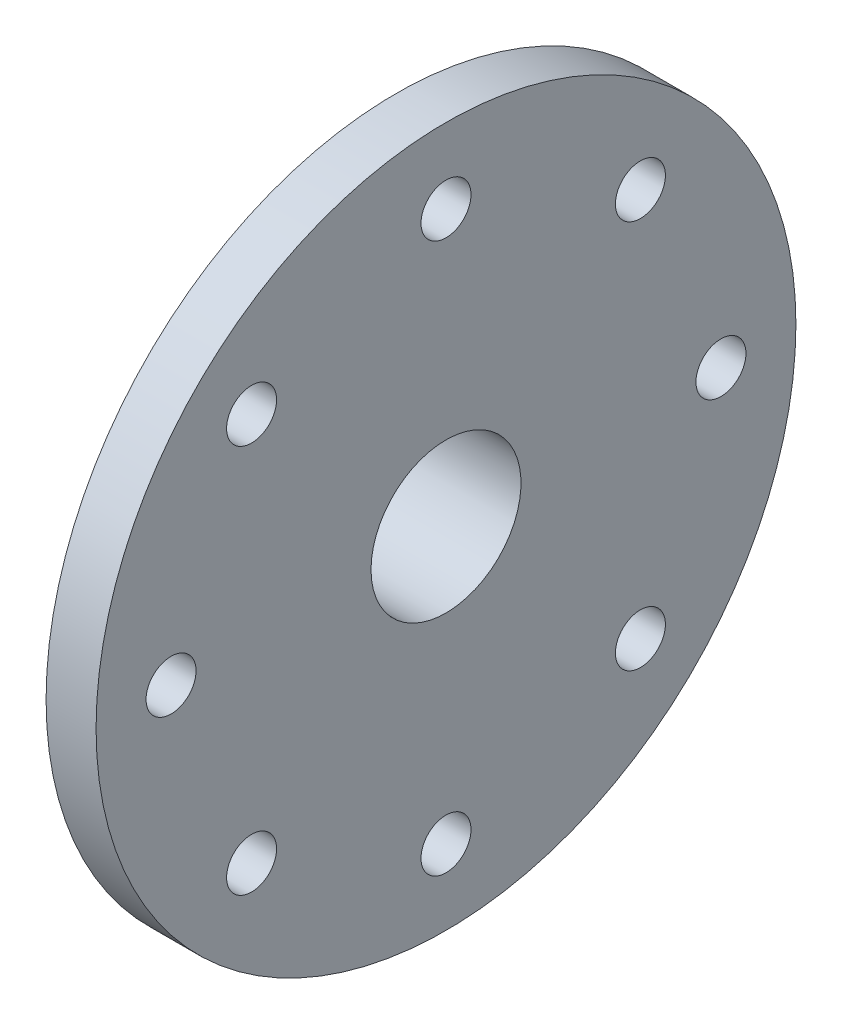
ISO-10303-21;
HEADER;
FILE_DESCRIPTION(('STEP AP214'),'2;1');
FILE_NAME('part.step','',(''),(''),'','','');
FILE_SCHEMA(('AUTOMOTIVE_DESIGN { 1 0 10303 214 1 1 1 1 }'));
ENDSEC;
DATA;
#1=APPLICATION_CONTEXT('core data for automotive mechanical design processes');
#2=APPLICATION_PROTOCOL_DEFINITION('international standard','automotive_design',2000,#1);
#3=PRODUCT_CONTEXT('',#1,'mechanical');
#4=PRODUCT('Part','Part','',(#3));
#5=PRODUCT_RELATED_PRODUCT_CATEGORY('part','',(#4));
#6=PRODUCT_DEFINITION_FORMATION('','',#4);
#7=PRODUCT_DEFINITION_CONTEXT('part definition',#1,'design');
#8=PRODUCT_DEFINITION('design','',#6,#7);
#9=PRODUCT_DEFINITION_SHAPE('','',#8);
#10=(LENGTH_UNIT() NAMED_UNIT(*) SI_UNIT(.MILLI.,.METRE.));
#11=(NAMED_UNIT(*) PLANE_ANGLE_UNIT() SI_UNIT($,.RADIAN.));
#12=(NAMED_UNIT(*) SI_UNIT($,.STERADIAN.) SOLID_ANGLE_UNIT());
#13=UNCERTAINTY_MEASURE_WITH_UNIT(LENGTH_MEASURE(1.E-05),#10,'distance_accuracy_value','');
#14=(GEOMETRIC_REPRESENTATION_CONTEXT(3) GLOBAL_UNCERTAINTY_ASSIGNED_CONTEXT((#13)) GLOBAL_UNIT_ASSIGNED_CONTEXT((#10,
#11,#12)) REPRESENTATION_CONTEXT('',''));
#15=CARTESIAN_POINT('',(0.,0.,0.));
#16=DIRECTION('',(0.,0.,1.));
#17=DIRECTION('',(1.,0.,0.));
#18=AXIS2_PLACEMENT_3D('',#15,#16,#17);
#19=CARTESIAN_POINT('',(-5.,1.5,0.));
#20=DIRECTION('',(1.,0.,0.));
#21=DIRECTION('',(0.,0.,-1.));
#22=AXIS2_PLACEMENT_3D('',#19,#20,#21);
#23=PLANE('',#22);
#24=CARTESIAN_POINT('',(-5.,0.,0.));
#25=DIRECTION('',(-1.,0.,0.));
#26=DIRECTION('',(0.,0.,1.));
#27=AXIS2_PLACEMENT_3D('',#24,#25,#26);
#28=CIRCLE('',#27,1.5);
#29=CARTESIAN_POINT('',(-5.,0.,1.5));
#30=VERTEX_POINT('',#29);
#31=EDGE_CURVE('E42',#30,#30,#28,.T.);
#32=ORIENTED_EDGE('',*,*,#31,.F.);
#33=EDGE_LOOP('',(#32));
#34=FACE_BOUND('',#33,.T.);
#35=CARTESIAN_POINT('',(-5.,0.,0.));
#36=DIRECTION('',(-1.,0.,0.));
#37=DIRECTION('',(0.,0.,1.));
#38=AXIS2_PLACEMENT_3D('',#35,#36,#37);
#39=CIRCLE('',#38,3.75);
#40=CARTESIAN_POINT('',(-5.,0.,3.75));
#41=VERTEX_POINT('',#40);
#42=EDGE_CURVE('E9',#41,#41,#39,.T.);
#43=ORIENTED_EDGE('',*,*,#42,.T.);
#44=EDGE_LOOP('',(#43));
#45=FACE_BOUND('',#44,.T.);
#46=ADVANCED_FACE('F14',(#34,#45),#23,.F.);
#47=CARTESIAN_POINT('',(0.,0.,0.));
#48=DIRECTION('',(-1.,0.,0.));
#49=DIRECTION('',(0.,0.,1.));
#50=AXIS2_PLACEMENT_3D('',#47,#48,#49);
#51=CYLINDRICAL_SURFACE('',#50,3.75);
#52=ORIENTED_EDGE('',*,*,#42,.F.);
#53=EDGE_LOOP('',(#52));
#54=FACE_BOUND('',#53,.T.);
#55=CARTESIAN_POINT('',(-2.,0.,0.));
#56=DIRECTION('',(-1.,0.,0.));
#57=DIRECTION('',(0.,0.,1.));
#58=AXIS2_PLACEMENT_3D('',#55,#56,#57);
#59=CIRCLE('',#58,3.75);
#60=CARTESIAN_POINT('',(-2.,0.,3.75));
#61=VERTEX_POINT('',#60);
#62=EDGE_CURVE('E20',#61,#61,#59,.T.);
#63=ORIENTED_EDGE('',*,*,#62,.T.);
#64=EDGE_LOOP('',(#63));
#65=FACE_BOUND('',#64,.T.);
#66=ADVANCED_FACE('F140',(#54,#65),#51,.T.);
#67=CARTESIAN_POINT('',(-2.,3.75,0.));
#68=DIRECTION('',(1.,0.,0.));
#69=DIRECTION('',(0.,0.,-1.));
#70=AXIS2_PLACEMENT_3D('',#67,#68,#69);
#71=PLANE('',#70);
#72=CARTESIAN_POINT('',(-2.,7.77817459305212,7.77817459305193));
#73=DIRECTION('',(1.,0.,0.));
#74=DIRECTION('',(0.,0.,-1.));
#75=AXIS2_PLACEMENT_3D('',#72,#73,#74);
#76=CIRCLE('',#75,1.);
#77=CARTESIAN_POINT('',(-2.,7.77817459305212,6.77817459305193));
#78=VERTEX_POINT('',#77);
#79=EDGE_CURVE('E87',#78,#78,#76,.T.);
#80=ORIENTED_EDGE('',*,*,#79,.T.);
#81=EDGE_LOOP('',(#80));
#82=FACE_BOUND('',#81,.T.);
#83=CARTESIAN_POINT('',(-2.,1.15218884181823E-13,11.));
#84=DIRECTION('',(1.,0.,0.));
#85=DIRECTION('',(0.,0.,-1.));
#86=AXIS2_PLACEMENT_3D('',#83,#84,#85);
#87=CIRCLE('',#86,1.);
#88=CARTESIAN_POINT('',(-2.,1.15218884181823E-13,10.));
#89=VERTEX_POINT('',#88);
#90=EDGE_CURVE('E81',#89,#89,#87,.T.);
#91=ORIENTED_EDGE('',*,*,#90,.T.);
#92=EDGE_LOOP('',(#91));
#93=FACE_BOUND('',#92,.T.);
#94=CARTESIAN_POINT('',(-2.,-7.77817459305195,7.77817459305209));
#95=DIRECTION('',(1.,0.,0.));
#96=DIRECTION('',(0.,0.,-1.));
#97=AXIS2_PLACEMENT_3D('',#94,#95,#96);
#98=CIRCLE('',#97,1.);
#99=CARTESIAN_POINT('',(-2.,-7.77817459305195,6.77817459305209));
#100=VERTEX_POINT('',#99);
#101=EDGE_CURVE('E75',#100,#100,#98,.T.);
#102=ORIENTED_EDGE('',*,*,#101,.T.);
#103=EDGE_LOOP('',(#102));
#104=FACE_BOUND('',#103,.T.);
#105=CARTESIAN_POINT('',(-2.,-11.,0.));
#106=DIRECTION('',(1.,0.,0.));
#107=DIRECTION('',(0.,0.,-1.));
#108=AXIS2_PLACEMENT_3D('',#105,#106,#107);
#109=CIRCLE('',#108,1.);
#110=CARTESIAN_POINT('',(-2.,-11.,-1.));
#111=VERTEX_POINT('',#110);
#112=EDGE_CURVE('E69',#111,#111,#109,.T.);
#113=ORIENTED_EDGE('',*,*,#112,.T.);
#114=EDGE_LOOP('',(#113));
#115=FACE_BOUND('',#114,.T.);
#116=CARTESIAN_POINT('',(-2.,-7.77817459305206,-7.77817459305198));
#117=DIRECTION('',(1.,0.,0.));
#118=DIRECTION('',(0.,0.,-1.));
#119=AXIS2_PLACEMENT_3D('',#116,#117,#118);
#120=CIRCLE('',#119,1.);
#121=CARTESIAN_POINT('',(-2.,-7.77817459305206,-8.77817459305198));
#122=VERTEX_POINT('',#121);
#123=EDGE_CURVE('E63',#122,#122,#120,.T.);
#124=ORIENTED_EDGE('',*,*,#123,.T.);
#125=EDGE_LOOP('',(#124));
#126=FACE_BOUND('',#125,.T.);
#127=CARTESIAN_POINT('',(-2.,0.,-11.));
#128=DIRECTION('',(1.,0.,0.));
#129=DIRECTION('',(0.,0.,-1.));
#130=AXIS2_PLACEMENT_3D('',#127,#128,#129);
#131=CIRCLE('',#130,1.);
#132=CARTESIAN_POINT('',(-2.,0.,-12.));
#133=VERTEX_POINT('',#132);
#134=EDGE_CURVE('E57',#133,#133,#131,.T.);
#135=ORIENTED_EDGE('',*,*,#134,.T.);
#136=EDGE_LOOP('',(#135));
#137=FACE_BOUND('',#136,.T.);
#138=CARTESIAN_POINT('',(-2.,7.77817459305201,-7.77817459305204));
#139=DIRECTION('',(1.,0.,0.));
#140=DIRECTION('',(0.,0.,-1.));
#141=AXIS2_PLACEMENT_3D('',#138,#139,#140);
#142=CIRCLE('',#141,1.);
#143=CARTESIAN_POINT('',(-2.,7.77817459305201,-8.77817459305204));
#144=VERTEX_POINT('',#143);
#145=EDGE_CURVE('E51',#144,#144,#142,.T.);
#146=ORIENTED_EDGE('',*,*,#145,.T.);
#147=EDGE_LOOP('',(#146));
#148=FACE_BOUND('',#147,.T.);
#149=CARTESIAN_POINT('',(-2.,11.,0.));
#150=DIRECTION('',(1.,0.,0.));
#151=DIRECTION('',(0.,0.,-1.));
#152=AXIS2_PLACEMENT_3D('',#149,#150,#151);
#153=CIRCLE('',#152,1.);
#154=CARTESIAN_POINT('',(-2.,11.,-1.));
#155=VERTEX_POINT('',#154);
#156=EDGE_CURVE('E45',#155,#155,#153,.T.);
#157=ORIENTED_EDGE('',*,*,#156,.T.);
#158=EDGE_LOOP('',(#157));
#159=FACE_BOUND('',#158,.T.);
#160=ORIENTED_EDGE('',*,*,#62,.F.);
#161=EDGE_LOOP('',(#160));
#162=FACE_BOUND('',#161,.T.);
#163=CARTESIAN_POINT('',(-2.,0.,0.));
#164=DIRECTION('',(-1.,0.,0.));
#165=DIRECTION('',(0.,0.,1.));
#166=AXIS2_PLACEMENT_3D('',#163,#164,#165);
#167=CIRCLE('',#166,14.);
#168=CARTESIAN_POINT('',(-2.,0.,14.));
#169=VERTEX_POINT('',#168);
#170=EDGE_CURVE('E24',#169,#169,#167,.T.);
#171=ORIENTED_EDGE('',*,*,#170,.T.);
#172=EDGE_LOOP('',(#171));
#173=FACE_BOUND('',#172,.T.);
#174=ADVANCED_FACE('F146',(#82,#93,#104,#115,#126,#137,#148,#159,#162,#173),#71,.F.);
#175=CARTESIAN_POINT('',(0.,0.,0.));
#176=DIRECTION('',(-1.,0.,0.));
#177=DIRECTION('',(0.,0.,1.));
#178=AXIS2_PLACEMENT_3D('',#175,#176,#177);
#179=CYLINDRICAL_SURFACE('',#178,14.);
#180=ORIENTED_EDGE('',*,*,#170,.F.);
#181=EDGE_LOOP('',(#180));
#182=FACE_BOUND('',#181,.T.);
#183=CARTESIAN_POINT('',(0.,0.,0.));
#184=DIRECTION('',(-1.,0.,0.));
#185=DIRECTION('',(0.,0.,1.));
#186=AXIS2_PLACEMENT_3D('',#183,#184,#185);
#187=CIRCLE('',#186,14.);
#188=CARTESIAN_POINT('',(0.,0.,14.));
#189=VERTEX_POINT('',#188);
#190=EDGE_CURVE('E28',#189,#189,#187,.T.);
#191=ORIENTED_EDGE('',*,*,#190,.T.);
#192=EDGE_LOOP('',(#191));
#193=FACE_BOUND('',#192,.T.);
#194=ADVANCED_FACE('F101',(#182,#193),#179,.T.);
#195=CARTESIAN_POINT('',(0.,14.,0.));
#196=DIRECTION('',(-1.,0.,0.));
#197=DIRECTION('',(0.,0.,1.));
#198=AXIS2_PLACEMENT_3D('',#195,#196,#197);
#199=PLANE('',#198);
#200=CARTESIAN_POINT('',(0.,7.77817459305212,7.77817459305193));
#201=DIRECTION('',(1.,0.,0.));
#202=DIRECTION('',(0.,0.707106781186539,-0.707106781186556));
#203=AXIS2_PLACEMENT_3D('',#200,#201,#202);
#204=CIRCLE('',#203,1.);
#205=CARTESIAN_POINT('',(0.,8.48528137423866,7.07106781186537));
#206=VERTEX_POINT('',#205);
#207=EDGE_CURVE('E90',#206,#206,#204,.T.);
#208=ORIENTED_EDGE('',*,*,#207,.F.);
#209=EDGE_LOOP('',(#208));
#210=FACE_BOUND('',#209,.T.);
#211=CARTESIAN_POINT('',(0.,1.15218884181823E-13,11.));
#212=DIRECTION('',(1.,0.,0.));
#213=DIRECTION('',(0.,1.,0.));
#214=AXIS2_PLACEMENT_3D('',#211,#212,#213);
#215=CIRCLE('',#214,1.);
#216=CARTESIAN_POINT('',(0.,1.00000000000012,11.));
#217=VERTEX_POINT('',#216);
#218=EDGE_CURVE('E84',#217,#217,#215,.T.);
#219=ORIENTED_EDGE('',*,*,#218,.F.);
#220=EDGE_LOOP('',(#219));
#221=FACE_BOUND('',#220,.T.);
#222=CARTESIAN_POINT('',(0.,-7.77817459305195,7.77817459305209));
#223=DIRECTION('',(1.,0.,0.));
#224=DIRECTION('',(0.,0.707106781186554,0.707106781186541));
#225=AXIS2_PLACEMENT_3D('',#222,#223,#224);
#226=CIRCLE('',#225,1.);
#227=CARTESIAN_POINT('',(0.,-7.0710678118654,8.48528137423863));
#228=VERTEX_POINT('',#227);
#229=EDGE_CURVE('E78',#228,#228,#226,.T.);
#230=ORIENTED_EDGE('',*,*,#229,.F.);
#231=EDGE_LOOP('',(#230));
#232=FACE_BOUND('',#231,.T.);
#233=CARTESIAN_POINT('',(0.,-11.,0.));
#234=DIRECTION('',(1.,0.,0.));
#235=DIRECTION('',(0.,0.,1.));
#236=AXIS2_PLACEMENT_3D('',#233,#234,#235);
#237=CIRCLE('',#236,1.);
#238=CARTESIAN_POINT('',(0.,-11.,1.));
#239=VERTEX_POINT('',#238);
#240=EDGE_CURVE('E72',#239,#239,#237,.T.);
#241=ORIENTED_EDGE('',*,*,#240,.F.);
#242=EDGE_LOOP('',(#241));
#243=FACE_BOUND('',#242,.T.);
#244=CARTESIAN_POINT('',(0.,-7.77817459305206,-7.77817459305198));
#245=DIRECTION('',(1.,0.,0.));
#246=DIRECTION('',(0.,-0.707106781186544,0.707106781186551));
#247=AXIS2_PLACEMENT_3D('',#244,#245,#246);
#248=CIRCLE('',#247,1.);
#249=CARTESIAN_POINT('',(0.,-8.48528137423861,-7.07106781186543));
#250=VERTEX_POINT('',#249);
#251=EDGE_CURVE('E66',#250,#250,#248,.T.);
#252=ORIENTED_EDGE('',*,*,#251,.F.);
#253=EDGE_LOOP('',(#252));
#254=FACE_BOUND('',#253,.T.);
#255=CARTESIAN_POINT('',(0.,0.,-11.));
#256=DIRECTION('',(1.,0.,0.));
#257=DIRECTION('',(0.,-1.,0.));
#258=AXIS2_PLACEMENT_3D('',#255,#256,#257);
#259=CIRCLE('',#258,1.);
#260=CARTESIAN_POINT('',(0.,-1.00000000000004,-11.));
#261=VERTEX_POINT('',#260);
#262=EDGE_CURVE('E60',#261,#261,#259,.T.);
#263=ORIENTED_EDGE('',*,*,#262,.F.);
#264=EDGE_LOOP('',(#263));
#265=FACE_BOUND('',#264,.T.);
#266=CARTESIAN_POINT('',(0.,7.77817459305201,-7.77817459305204));
#267=DIRECTION('',(1.,0.,0.));
#268=DIRECTION('',(0.,-0.707106781186549,-0.707106781186546));
#269=AXIS2_PLACEMENT_3D('',#266,#267,#268);
#270=CIRCLE('',#269,1.);
#271=CARTESIAN_POINT('',(0.,7.07106781186546,-8.48528137423859));
#272=VERTEX_POINT('',#271);
#273=EDGE_CURVE('E54',#272,#272,#270,.T.);
#274=ORIENTED_EDGE('',*,*,#273,.F.);
#275=EDGE_LOOP('',(#274));
#276=FACE_BOUND('',#275,.T.);
#277=CARTESIAN_POINT('',(0.,11.,0.));
#278=DIRECTION('',(1.,0.,0.));
#279=DIRECTION('',(0.,0.,-1.));
#280=AXIS2_PLACEMENT_3D('',#277,#278,#279);
#281=CIRCLE('',#280,1.);
#282=CARTESIAN_POINT('',(0.,11.,-1.));
#283=VERTEX_POINT('',#282);
#284=EDGE_CURVE('E48',#283,#283,#281,.T.);
#285=ORIENTED_EDGE('',*,*,#284,.F.);
#286=EDGE_LOOP('',(#285));
#287=FACE_BOUND('',#286,.T.);
#288=ORIENTED_EDGE('',*,*,#190,.F.);
#289=EDGE_LOOP('',(#288));
#290=FACE_BOUND('',#289,.T.);
#291=CARTESIAN_POINT('',(0.,0.,0.));
#292=DIRECTION('',(-1.,0.,0.));
#293=DIRECTION('',(0.,0.,1.));
#294=AXIS2_PLACEMENT_3D('',#291,#292,#293);
#295=CIRCLE('',#294,3.);
#296=CARTESIAN_POINT('',(0.,0.,3.));
#297=VERTEX_POINT('',#296);
#298=EDGE_CURVE('E33',#297,#297,#295,.T.);
#299=ORIENTED_EDGE('',*,*,#298,.T.);
#300=EDGE_LOOP('',(#299));
#301=FACE_BOUND('',#300,.T.);
#302=ADVANCED_FACE('F97',(#210,#221,#232,#243,#254,#265,#276,#287,#290,#301),#199,.F.);
#303=CARTESIAN_POINT('',(0.,0.,0.));
#304=DIRECTION('',(-1.,0.,0.));
#305=DIRECTION('',(0.,0.,1.));
#306=AXIS2_PLACEMENT_3D('',#303,#304,#305);
#307=CYLINDRICAL_SURFACE('',#306,3.);
#308=ORIENTED_EDGE('',*,*,#298,.F.);
#309=EDGE_LOOP('',(#308));
#310=FACE_BOUND('',#309,.T.);
#311=CARTESIAN_POINT('',(-4.5,0.,0.));
#312=DIRECTION('',(-1.,0.,0.));
#313=DIRECTION('',(0.,0.,1.));
#314=AXIS2_PLACEMENT_3D('',#311,#312,#313);
#315=CIRCLE('',#314,3.);
#316=CARTESIAN_POINT('',(-4.5,0.,3.));
#317=VERTEX_POINT('',#316);
#318=EDGE_CURVE('E36',#317,#317,#315,.T.);
#319=ORIENTED_EDGE('',*,*,#318,.T.);
#320=EDGE_LOOP('',(#319));
#321=FACE_BOUND('',#320,.T.);
#322=ADVANCED_FACE('F100',(#310,#321),#307,.F.);
#323=CARTESIAN_POINT('',(-4.5,3.,0.));
#324=DIRECTION('',(-1.,0.,0.));
#325=DIRECTION('',(0.,0.,1.));
#326=AXIS2_PLACEMENT_3D('',#323,#324,#325);
#327=PLANE('',#326);
#328=ORIENTED_EDGE('',*,*,#318,.F.);
#329=EDGE_LOOP('',(#328));
#330=FACE_BOUND('',#329,.T.);
#331=CARTESIAN_POINT('',(-4.5,0.,0.));
#332=DIRECTION('',(-1.,0.,0.));
#333=DIRECTION('',(0.,0.,1.));
#334=AXIS2_PLACEMENT_3D('',#331,#332,#333);
#335=CIRCLE('',#334,1.5);
#336=CARTESIAN_POINT('',(-4.5,0.,1.5));
#337=VERTEX_POINT('',#336);
#338=EDGE_CURVE('E39',#337,#337,#335,.T.);
#339=ORIENTED_EDGE('',*,*,#338,.T.);
#340=EDGE_LOOP('',(#339));
#341=FACE_BOUND('',#340,.T.);
#342=ADVANCED_FACE('F123',(#330,#341),#327,.F.);
#343=CARTESIAN_POINT('',(0.,0.,0.));
#344=DIRECTION('',(-1.,0.,0.));
#345=DIRECTION('',(0.,0.,1.));
#346=AXIS2_PLACEMENT_3D('',#343,#344,#345);
#347=CYLINDRICAL_SURFACE('',#346,1.5);
#348=ORIENTED_EDGE('',*,*,#338,.F.);
#349=EDGE_LOOP('',(#348));
#350=FACE_BOUND('',#349,.T.);
#351=ORIENTED_EDGE('',*,*,#31,.T.);
#352=EDGE_LOOP('',(#351));
#353=FACE_BOUND('',#352,.T.);
#354=ADVANCED_FACE('F129',(#350,#353),#347,.F.);
#355=CARTESIAN_POINT('',(-5.,11.,0.));
#356=DIRECTION('',(1.,0.,0.));
#357=DIRECTION('',(0.,0.,-1.));
#358=AXIS2_PLACEMENT_3D('',#355,#356,#357);
#359=CYLINDRICAL_SURFACE('',#358,1.);
#360=ORIENTED_EDGE('',*,*,#284,.T.);
#361=EDGE_LOOP('',(#360));
#362=FACE_BOUND('',#361,.T.);
#363=ORIENTED_EDGE('',*,*,#156,.F.);
#364=EDGE_LOOP('',(#363));
#365=FACE_BOUND('',#364,.T.);
#366=ADVANCED_FACE('F135',(#362,#365),#359,.F.);
#367=CARTESIAN_POINT('',(-5.,7.77817459305201,-7.77817459305204));
#368=DIRECTION('',(1.,0.,0.));
#369=DIRECTION('',(0.,0.,-1.));
#370=AXIS2_PLACEMENT_3D('',#367,#368,#369);
#371=CYLINDRICAL_SURFACE('',#370,1.);
#372=ORIENTED_EDGE('',*,*,#273,.T.);
#373=EDGE_LOOP('',(#372));
#374=FACE_BOUND('',#373,.T.);
#375=ORIENTED_EDGE('',*,*,#145,.F.);
#376=EDGE_LOOP('',(#375));
#377=FACE_BOUND('',#376,.T.);
#378=ADVANCED_FACE('F160',(#374,#377),#371,.F.);
#379=CARTESIAN_POINT('',(-5.,0.,-11.));
#380=DIRECTION('',(1.,0.,0.));
#381=DIRECTION('',(0.,0.,-1.));
#382=AXIS2_PLACEMENT_3D('',#379,#380,#381);
#383=CYLINDRICAL_SURFACE('',#382,1.);
#384=ORIENTED_EDGE('',*,*,#262,.T.);
#385=EDGE_LOOP('',(#384));
#386=FACE_BOUND('',#385,.T.);
#387=ORIENTED_EDGE('',*,*,#134,.F.);
#388=EDGE_LOOP('',(#387));
#389=FACE_BOUND('',#388,.T.);
#390=ADVANCED_FACE('F164',(#386,#389),#383,.F.);
#391=CARTESIAN_POINT('',(-5.,-7.77817459305206,-7.77817459305198));
#392=DIRECTION('',(1.,0.,0.));
#393=DIRECTION('',(0.,0.,-1.));
#394=AXIS2_PLACEMENT_3D('',#391,#392,#393);
#395=CYLINDRICAL_SURFACE('',#394,1.);
#396=ORIENTED_EDGE('',*,*,#251,.T.);
#397=EDGE_LOOP('',(#396));
#398=FACE_BOUND('',#397,.T.);
#399=ORIENTED_EDGE('',*,*,#123,.F.);
#400=EDGE_LOOP('',(#399));
#401=FACE_BOUND('',#400,.T.);
#402=ADVANCED_FACE('F168',(#398,#401),#395,.F.);
#403=CARTESIAN_POINT('',(-5.,-11.,0.));
#404=DIRECTION('',(1.,0.,0.));
#405=DIRECTION('',(0.,0.,-1.));
#406=AXIS2_PLACEMENT_3D('',#403,#404,#405);
#407=CYLINDRICAL_SURFACE('',#406,1.);
#408=ORIENTED_EDGE('',*,*,#240,.T.);
#409=EDGE_LOOP('',(#408));
#410=FACE_BOUND('',#409,.T.);
#411=ORIENTED_EDGE('',*,*,#112,.F.);
#412=EDGE_LOOP('',(#411));
#413=FACE_BOUND('',#412,.T.);
#414=ADVANCED_FACE('F172',(#410,#413),#407,.F.);
#415=CARTESIAN_POINT('',(-5.,-7.77817459305195,7.77817459305209));
#416=DIRECTION('',(1.,0.,0.));
#417=DIRECTION('',(0.,0.,-1.));
#418=AXIS2_PLACEMENT_3D('',#415,#416,#417);
#419=CYLINDRICAL_SURFACE('',#418,1.);
#420=ORIENTED_EDGE('',*,*,#229,.T.);
#421=EDGE_LOOP('',(#420));
#422=FACE_BOUND('',#421,.T.);
#423=ORIENTED_EDGE('',*,*,#101,.F.);
#424=EDGE_LOOP('',(#423));
#425=FACE_BOUND('',#424,.T.);
#426=ADVANCED_FACE('F176',(#422,#425),#419,.F.);
#427=CARTESIAN_POINT('',(-5.,1.15218884181823E-13,11.));
#428=DIRECTION('',(1.,0.,0.));
#429=DIRECTION('',(0.,0.,-1.));
#430=AXIS2_PLACEMENT_3D('',#427,#428,#429);
#431=CYLINDRICAL_SURFACE('',#430,1.);
#432=ORIENTED_EDGE('',*,*,#218,.T.);
#433=EDGE_LOOP('',(#432));
#434=FACE_BOUND('',#433,.T.);
#435=ORIENTED_EDGE('',*,*,#90,.F.);
#436=EDGE_LOOP('',(#435));
#437=FACE_BOUND('',#436,.T.);
#438=ADVANCED_FACE('F180',(#434,#437),#431,.F.);
#439=CARTESIAN_POINT('',(-5.,7.77817459305212,7.77817459305193));
#440=DIRECTION('',(1.,0.,0.));
#441=DIRECTION('',(0.,0.,-1.));
#442=AXIS2_PLACEMENT_3D('',#439,#440,#441);
#443=CYLINDRICAL_SURFACE('',#442,1.);
#444=ORIENTED_EDGE('',*,*,#207,.T.);
#445=EDGE_LOOP('',(#444));
#446=FACE_BOUND('',#445,.T.);
#447=ORIENTED_EDGE('',*,*,#79,.F.);
#448=EDGE_LOOP('',(#447));
#449=FACE_BOUND('',#448,.T.);
#450=ADVANCED_FACE('F94',(#446,#449),#443,.F.);
#451=CLOSED_SHELL('',(#46,#66,#174,#194,#302,#322,#342,#354,#366,#378,#390,#402,#414,#426,#438,#450));
#452=MANIFOLD_SOLID_BREP('B1',#451);
#453=ADVANCED_BREP_SHAPE_REPRESENTATION('',(#18,#452),#14);
#454=SHAPE_DEFINITION_REPRESENTATION(#9,#453);
ENDSEC;
END-ISO-10303-21;
